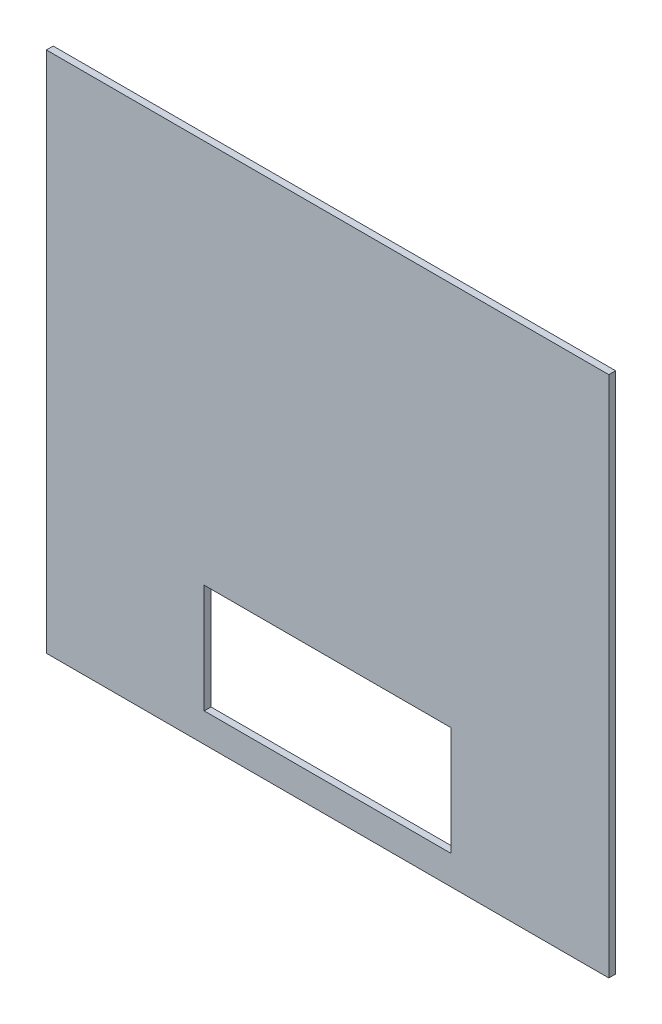
ISO-10303-21;
HEADER;
FILE_DESCRIPTION(('STEP AP214'),'2;1');
FILE_NAME('part.step','',(''),(''),'','','');
FILE_SCHEMA(('AUTOMOTIVE_DESIGN { 1 0 10303 214 1 1 1 1 }'));
ENDSEC;
DATA;
#1=APPLICATION_CONTEXT('core data for automotive mechanical design processes');
#2=APPLICATION_PROTOCOL_DEFINITION('international standard','automotive_design',2000,#1);
#3=PRODUCT_CONTEXT('',#1,'mechanical');
#4=PRODUCT('Part','Part','',(#3));
#5=PRODUCT_RELATED_PRODUCT_CATEGORY('part','',(#4));
#6=PRODUCT_DEFINITION_FORMATION('','',#4);
#7=PRODUCT_DEFINITION_CONTEXT('part definition',#1,'design');
#8=PRODUCT_DEFINITION('design','',#6,#7);
#9=PRODUCT_DEFINITION_SHAPE('','',#8);
#10=(LENGTH_UNIT() NAMED_UNIT(*) SI_UNIT(.MILLI.,.METRE.));
#11=(NAMED_UNIT(*) PLANE_ANGLE_UNIT() SI_UNIT($,.RADIAN.));
#12=(NAMED_UNIT(*) SI_UNIT($,.STERADIAN.) SOLID_ANGLE_UNIT());
#13=UNCERTAINTY_MEASURE_WITH_UNIT(LENGTH_MEASURE(1.E-05),#10,'distance_accuracy_value','');
#14=(GEOMETRIC_REPRESENTATION_CONTEXT(3) GLOBAL_UNCERTAINTY_ASSIGNED_CONTEXT((#13)) GLOBAL_UNIT_ASSIGNED_CONTEXT((#10,
#11,#12)) REPRESENTATION_CONTEXT('',''));
#15=CARTESIAN_POINT('',(0.,0.,0.));
#16=DIRECTION('',(0.,0.,1.));
#17=DIRECTION('',(1.,0.,0.));
#18=AXIS2_PLACEMENT_3D('',#15,#16,#17);
#19=CARTESIAN_POINT('',(492.125,-457.2,11.90625));
#20=DIRECTION('',(-1.,0.,0.));
#21=DIRECTION('',(0.,0.,1.));
#22=AXIS2_PLACEMENT_3D('',#19,#20,#21);
#23=PLANE('',#22);
#24=DIRECTION('',(0.,1.,0.));
#25=VECTOR('',#24,1.);
#26=CARTESIAN_POINT('',(492.125,-457.2,0.));
#27=LINE('',#26,#25);
#28=CARTESIAN_POINT('',(492.125,-457.2,0.));
#29=VERTEX_POINT('',#28);
#30=CARTESIAN_POINT('',(492.125,457.2,0.));
#31=VERTEX_POINT('',#30);
#32=EDGE_CURVE('E136',#29,#31,#27,.T.);
#33=ORIENTED_EDGE('',*,*,#32,.T.);
#34=DIRECTION('',(0.,0.,-1.));
#35=VECTOR('',#34,1.);
#36=CARTESIAN_POINT('',(492.125,457.2,11.90625));
#37=LINE('',#36,#35);
#38=CARTESIAN_POINT('',(492.125,457.2,11.90625));
#39=VERTEX_POINT('',#38);
#40=EDGE_CURVE('E11',#39,#31,#37,.T.);
#41=ORIENTED_EDGE('',*,*,#40,.F.);
#42=DIRECTION('',(0.,1.,0.));
#43=VECTOR('',#42,1.);
#44=CARTESIAN_POINT('',(492.125,-457.2,11.90625));
#45=LINE('',#44,#43);
#46=CARTESIAN_POINT('',(492.125,-457.2,11.90625));
#47=VERTEX_POINT('',#46);
#48=EDGE_CURVE('E137',#47,#39,#45,.T.);
#49=ORIENTED_EDGE('',*,*,#48,.F.);
#50=DIRECTION('',(0.,0.,-1.));
#51=VECTOR('',#50,1.);
#52=CARTESIAN_POINT('',(492.125,-457.2,11.90625));
#53=LINE('',#52,#51);
#54=EDGE_CURVE('E147',#47,#29,#53,.T.);
#55=ORIENTED_EDGE('',*,*,#54,.T.);
#56=EDGE_LOOP('',(#33,#41,#49,#55));
#57=FACE_BOUND('',#56,.T.);
#58=ADVANCED_FACE('F34',(#57),#23,.F.);
#59=CARTESIAN_POINT('',(-492.125,457.2,11.90625));
#60=DIRECTION('',(0.,-1.,0.));
#61=DIRECTION('',(0.,0.,-1.));
#62=AXIS2_PLACEMENT_3D('',#59,#60,#61);
#63=PLANE('',#62);
#64=DIRECTION('',(-1.,0.,0.));
#65=VECTOR('',#64,1.);
#66=CARTESIAN_POINT('',(-492.125,457.2,0.));
#67=LINE('',#66,#65);
#68=CARTESIAN_POINT('',(-492.125,457.2,0.));
#69=VERTEX_POINT('',#68);
#70=EDGE_CURVE('E150',#31,#69,#67,.T.);
#71=ORIENTED_EDGE('',*,*,#70,.T.);
#72=DIRECTION('',(0.,0.,-1.));
#73=VECTOR('',#72,1.);
#74=CARTESIAN_POINT('',(-492.125,457.2,11.90625));
#75=LINE('',#74,#73);
#76=CARTESIAN_POINT('',(-492.125,457.2,11.90625));
#77=VERTEX_POINT('',#76);
#78=EDGE_CURVE('E41',#77,#69,#75,.T.);
#79=ORIENTED_EDGE('',*,*,#78,.F.);
#80=DIRECTION('',(-1.,0.,0.));
#81=VECTOR('',#80,1.);
#82=CARTESIAN_POINT('',(-492.125,457.2,11.90625));
#83=LINE('',#82,#81);
#84=EDGE_CURVE('E140',#39,#77,#83,.T.);
#85=ORIENTED_EDGE('',*,*,#84,.F.);
#86=ORIENTED_EDGE('',*,*,#40,.T.);
#87=EDGE_LOOP('',(#71,#79,#85,#86));
#88=FACE_BOUND('',#87,.T.);
#89=ADVANCED_FACE('F178',(#88),#63,.F.);
#90=CARTESIAN_POINT('',(-492.125,-457.2,11.90625));
#91=DIRECTION('',(1.,0.,0.));
#92=DIRECTION('',(0.,0.,-1.));
#93=AXIS2_PLACEMENT_3D('',#90,#91,#92);
#94=PLANE('',#93);
#95=DIRECTION('',(0.,-1.,0.));
#96=VECTOR('',#95,1.);
#97=CARTESIAN_POINT('',(-492.125,-457.2,0.));
#98=LINE('',#97,#96);
#99=CARTESIAN_POINT('',(-492.125,-457.2,0.));
#100=VERTEX_POINT('',#99);
#101=EDGE_CURVE('E152',#69,#100,#98,.T.);
#102=ORIENTED_EDGE('',*,*,#101,.T.);
#103=DIRECTION('',(0.,0.,-1.));
#104=VECTOR('',#103,1.);
#105=CARTESIAN_POINT('',(-492.125,-457.2,11.90625));
#106=LINE('',#105,#104);
#107=CARTESIAN_POINT('',(-492.125,-457.2,11.90625));
#108=VERTEX_POINT('',#107);
#109=EDGE_CURVE('E157',#108,#100,#106,.T.);
#110=ORIENTED_EDGE('',*,*,#109,.F.);
#111=DIRECTION('',(0.,-1.,0.));
#112=VECTOR('',#111,1.);
#113=CARTESIAN_POINT('',(-492.125,-457.2,11.90625));
#114=LINE('',#113,#112);
#115=EDGE_CURVE('E143',#77,#108,#114,.T.);
#116=ORIENTED_EDGE('',*,*,#115,.F.);
#117=ORIENTED_EDGE('',*,*,#78,.T.);
#118=EDGE_LOOP('',(#102,#110,#116,#117));
#119=FACE_BOUND('',#118,.T.);
#120=ADVANCED_FACE('F164',(#119),#94,.F.);
#121=CARTESIAN_POINT('',(-492.125,-457.2,11.90625));
#122=DIRECTION('',(0.,1.,0.));
#123=DIRECTION('',(0.,0.,1.));
#124=AXIS2_PLACEMENT_3D('',#121,#122,#123);
#125=PLANE('',#124);
#126=DIRECTION('',(1.,0.,0.));
#127=VECTOR('',#126,1.);
#128=CARTESIAN_POINT('',(-492.125,-457.2,0.));
#129=LINE('',#128,#127);
#130=EDGE_CURVE('E141',#100,#29,#129,.T.);
#131=ORIENTED_EDGE('',*,*,#130,.T.);
#132=ORIENTED_EDGE('',*,*,#54,.F.);
#133=DIRECTION('',(1.,0.,0.));
#134=VECTOR('',#133,1.);
#135=CARTESIAN_POINT('',(-492.125,-457.2,11.90625));
#136=LINE('',#135,#134);
#137=EDGE_CURVE('E145',#108,#47,#136,.T.);
#138=ORIENTED_EDGE('',*,*,#137,.F.);
#139=ORIENTED_EDGE('',*,*,#109,.T.);
#140=EDGE_LOOP('',(#131,#132,#138,#139));
#141=FACE_BOUND('',#140,.T.);
#142=ADVANCED_FACE('F171',(#141),#125,.F.);
#143=CARTESIAN_POINT('',(0.,0.,11.90625));
#144=DIRECTION('',(0.,0.,-1.));
#145=DIRECTION('',(-1.,0.,0.));
#146=AXIS2_PLACEMENT_3D('',#143,#144,#145);
#147=PLANE('',#146);
#148=DIRECTION('',(-1.,0.,0.));
#149=VECTOR('',#148,1.);
#150=CARTESIAN_POINT('',(0.,-406.4,11.90625));
#151=LINE('',#150,#149);
#152=CARTESIAN_POINT('',(215.9,-406.4,11.90625));
#153=VERTEX_POINT('',#152);
#154=CARTESIAN_POINT('',(-215.9,-406.4,11.90625));
#155=VERTEX_POINT('',#154);
#156=EDGE_CURVE('E125',#153,#155,#151,.T.);
#157=ORIENTED_EDGE('',*,*,#156,.T.);
#158=DIRECTION('',(0.,1.,0.));
#159=VECTOR('',#158,1.);
#160=CARTESIAN_POINT('',(-215.9,0.,11.90625));
#161=LINE('',#160,#159);
#162=CARTESIAN_POINT('',(-215.9,-215.9,11.90625));
#163=VERTEX_POINT('',#162);
#164=EDGE_CURVE('E133',#155,#163,#161,.T.);
#165=ORIENTED_EDGE('',*,*,#164,.T.);
#166=DIRECTION('',(1.,0.,0.));
#167=VECTOR('',#166,1.);
#168=CARTESIAN_POINT('',(0.,-215.9,11.90625));
#169=LINE('',#168,#167);
#170=CARTESIAN_POINT('',(215.9,-215.9,11.90625));
#171=VERTEX_POINT('',#170);
#172=EDGE_CURVE('E131',#163,#171,#169,.T.);
#173=ORIENTED_EDGE('',*,*,#172,.T.);
#174=DIRECTION('',(0.,-1.,0.));
#175=VECTOR('',#174,1.);
#176=CARTESIAN_POINT('',(215.9,0.,11.90625));
#177=LINE('',#176,#175);
#178=EDGE_CURVE('E101',#171,#153,#177,.T.);
#179=ORIENTED_EDGE('',*,*,#178,.T.);
#180=EDGE_LOOP('',(#157,#165,#173,#179));
#181=FACE_BOUND('',#180,.T.);
#182=ORIENTED_EDGE('',*,*,#48,.T.);
#183=ORIENTED_EDGE('',*,*,#84,.T.);
#184=ORIENTED_EDGE('',*,*,#115,.T.);
#185=ORIENTED_EDGE('',*,*,#137,.T.);
#186=EDGE_LOOP('',(#182,#183,#184,#185));
#187=FACE_BOUND('',#186,.T.);
#188=ADVANCED_FACE('F177',(#181,#187),#147,.F.);
#189=CARTESIAN_POINT('',(0.,0.,0.));
#190=DIRECTION('',(0.,0.,-1.));
#191=DIRECTION('',(-1.,0.,0.));
#192=AXIS2_PLACEMENT_3D('',#189,#190,#191);
#193=PLANE('',#192);
#194=DIRECTION('',(0.,-1.,0.));
#195=VECTOR('',#194,1.);
#196=CARTESIAN_POINT('',(-215.9,-215.9,0.));
#197=LINE('',#196,#195);
#198=CARTESIAN_POINT('',(-215.9,-215.9,0.));
#199=VERTEX_POINT('',#198);
#200=CARTESIAN_POINT('',(-215.9,-406.4,0.));
#201=VERTEX_POINT('',#200);
#202=EDGE_CURVE('E114',#199,#201,#197,.T.);
#203=ORIENTED_EDGE('',*,*,#202,.T.);
#204=DIRECTION('',(1.,0.,0.));
#205=VECTOR('',#204,1.);
#206=CARTESIAN_POINT('',(-215.9,-406.4,0.));
#207=LINE('',#206,#205);
#208=CARTESIAN_POINT('',(215.9,-406.4,0.));
#209=VERTEX_POINT('',#208);
#210=EDGE_CURVE('E119',#201,#209,#207,.T.);
#211=ORIENTED_EDGE('',*,*,#210,.T.);
#212=DIRECTION('',(0.,1.,0.));
#213=VECTOR('',#212,1.);
#214=CARTESIAN_POINT('',(215.9,-406.4,0.));
#215=LINE('',#214,#213);
#216=CARTESIAN_POINT('',(215.9,-215.9,0.));
#217=VERTEX_POINT('',#216);
#218=EDGE_CURVE('E56',#209,#217,#215,.T.);
#219=ORIENTED_EDGE('',*,*,#218,.T.);
#220=DIRECTION('',(-1.,0.,0.));
#221=VECTOR('',#220,1.);
#222=CARTESIAN_POINT('',(215.9,-215.9,0.));
#223=LINE('',#222,#221);
#224=EDGE_CURVE('E108',#217,#199,#223,.T.);
#225=ORIENTED_EDGE('',*,*,#224,.T.);
#226=EDGE_LOOP('',(#203,#211,#219,#225));
#227=FACE_BOUND('',#226,.T.);
#228=ORIENTED_EDGE('',*,*,#32,.F.);
#229=ORIENTED_EDGE('',*,*,#130,.F.);
#230=ORIENTED_EDGE('',*,*,#101,.F.);
#231=ORIENTED_EDGE('',*,*,#70,.F.);
#232=EDGE_LOOP('',(#228,#229,#230,#231));
#233=FACE_BOUND('',#232,.T.);
#234=ADVANCED_FACE('F117',(#227,#233),#193,.T.);
#235=CARTESIAN_POINT('',(-215.9,-215.9,0.));
#236=DIRECTION('',(-1.,0.,0.));
#237=DIRECTION('',(0.,-1.,0.));
#238=AXIS2_PLACEMENT_3D('',#235,#236,#237);
#239=PLANE('',#238);
#240=DIRECTION('',(0.,0.,1.));
#241=VECTOR('',#240,1.);
#242=CARTESIAN_POINT('',(-215.9,-406.4,0.));
#243=LINE('',#242,#241);
#244=EDGE_CURVE('E48',#201,#155,#243,.T.);
#245=ORIENTED_EDGE('',*,*,#244,.F.);
#246=ORIENTED_EDGE('',*,*,#202,.F.);
#247=DIRECTION('',(0.,0.,1.));
#248=VECTOR('',#247,1.);
#249=CARTESIAN_POINT('',(-215.9,-215.9,0.));
#250=LINE('',#249,#248);
#251=EDGE_CURVE('E104',#199,#163,#250,.T.);
#252=ORIENTED_EDGE('',*,*,#251,.T.);
#253=ORIENTED_EDGE('',*,*,#164,.F.);
#254=EDGE_LOOP('',(#245,#246,#252,#253));
#255=FACE_BOUND('',#254,.T.);
#256=ADVANCED_FACE('F190',(#255),#239,.F.);
#257=CARTESIAN_POINT('',(215.9,-215.9,0.));
#258=DIRECTION('',(0.,1.,0.));
#259=DIRECTION('',(-1.,0.,0.));
#260=AXIS2_PLACEMENT_3D('',#257,#258,#259);
#261=PLANE('',#260);
#262=ORIENTED_EDGE('',*,*,#251,.F.);
#263=ORIENTED_EDGE('',*,*,#224,.F.);
#264=DIRECTION('',(0.,0.,1.));
#265=VECTOR('',#264,1.);
#266=CARTESIAN_POINT('',(215.9,-215.9,0.));
#267=LINE('',#266,#265);
#268=EDGE_CURVE('E97',#217,#171,#267,.T.);
#269=ORIENTED_EDGE('',*,*,#268,.T.);
#270=ORIENTED_EDGE('',*,*,#172,.F.);
#271=EDGE_LOOP('',(#262,#263,#269,#270));
#272=FACE_BOUND('',#271,.T.);
#273=ADVANCED_FACE('F109',(#272),#261,.F.);
#274=CARTESIAN_POINT('',(215.9,-406.4,0.));
#275=DIRECTION('',(1.,0.,0.));
#276=DIRECTION('',(0.,0.,-1.));
#277=AXIS2_PLACEMENT_3D('',#274,#275,#276);
#278=PLANE('',#277);
#279=ORIENTED_EDGE('',*,*,#268,.F.);
#280=ORIENTED_EDGE('',*,*,#218,.F.);
#281=DIRECTION('',(0.,0.,1.));
#282=VECTOR('',#281,1.);
#283=CARTESIAN_POINT('',(215.9,-406.4,0.));
#284=LINE('',#283,#282);
#285=EDGE_CURVE('E105',#209,#153,#284,.T.);
#286=ORIENTED_EDGE('',*,*,#285,.T.);
#287=ORIENTED_EDGE('',*,*,#178,.F.);
#288=EDGE_LOOP('',(#279,#280,#286,#287));
#289=FACE_BOUND('',#288,.T.);
#290=ADVANCED_FACE('F99',(#289),#278,.F.);
#291=CARTESIAN_POINT('',(0.,-406.4,0.));
#292=DIRECTION('',(0.,-1.,0.));
#293=DIRECTION('',(0.,0.,-1.));
#294=AXIS2_PLACEMENT_3D('',#291,#292,#293);
#295=PLANE('',#294);
#296=ORIENTED_EDGE('',*,*,#285,.F.);
#297=ORIENTED_EDGE('',*,*,#210,.F.);
#298=ORIENTED_EDGE('',*,*,#244,.T.);
#299=ORIENTED_EDGE('',*,*,#156,.F.);
#300=EDGE_LOOP('',(#296,#297,#298,#299));
#301=FACE_BOUND('',#300,.T.);
#302=ADVANCED_FACE('F194',(#301),#295,.F.);
#303=CLOSED_SHELL('',(#58,#89,#120,#142,#188,#234,#256,#273,#290,#302));
#304=MANIFOLD_SOLID_BREP('B2',#303);
#305=ADVANCED_BREP_SHAPE_REPRESENTATION('',(#18,#304),#14);
#306=SHAPE_DEFINITION_REPRESENTATION(#9,#305);
ENDSEC;
END-ISO-10303-21;
